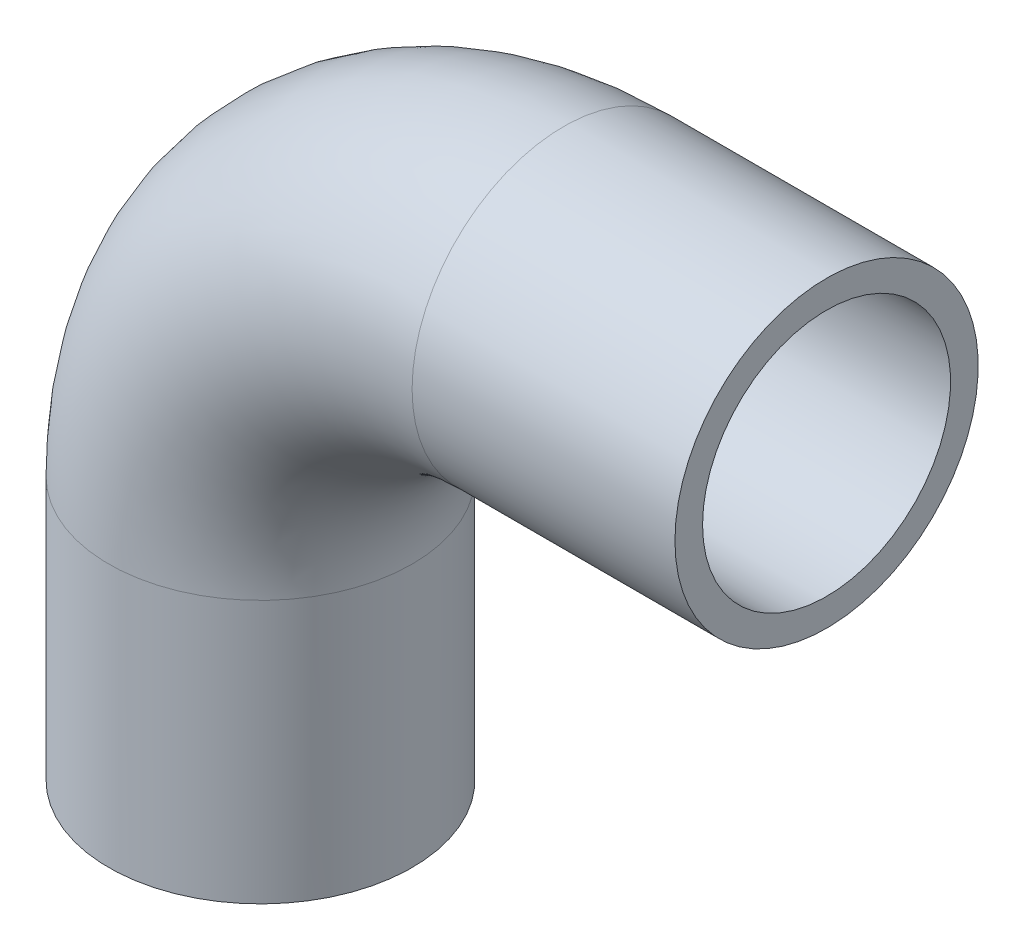
ISO-10303-21;
HEADER;
FILE_DESCRIPTION(('STEP AP214'),'2;1');
FILE_NAME('part.step','',(''),(''),'','','');
FILE_SCHEMA(('AUTOMOTIVE_DESIGN { 1 0 10303 214 1 1 1 1 }'));
ENDSEC;
DATA;
#1=APPLICATION_CONTEXT('core data for automotive mechanical design processes');
#2=APPLICATION_PROTOCOL_DEFINITION('international standard','automotive_design',2000,#1);
#3=PRODUCT_CONTEXT('',#1,'mechanical');
#4=PRODUCT('Part','Part','',(#3));
#5=PRODUCT_RELATED_PRODUCT_CATEGORY('part','',(#4));
#6=PRODUCT_DEFINITION_FORMATION('','',#4);
#7=PRODUCT_DEFINITION_CONTEXT('part definition',#1,'design');
#8=PRODUCT_DEFINITION('design','',#6,#7);
#9=PRODUCT_DEFINITION_SHAPE('','',#8);
#10=(LENGTH_UNIT() NAMED_UNIT(*) SI_UNIT(.MILLI.,.METRE.));
#11=(NAMED_UNIT(*) PLANE_ANGLE_UNIT() SI_UNIT($,.RADIAN.));
#12=(NAMED_UNIT(*) SI_UNIT($,.STERADIAN.) SOLID_ANGLE_UNIT());
#13=UNCERTAINTY_MEASURE_WITH_UNIT(LENGTH_MEASURE(1.E-05),#10,'distance_accuracy_value','');
#14=(GEOMETRIC_REPRESENTATION_CONTEXT(3) GLOBAL_UNCERTAINTY_ASSIGNED_CONTEXT((#13)) GLOBAL_UNIT_ASSIGNED_CONTEXT((#10,
#11,#12)) REPRESENTATION_CONTEXT('',''));
#15=CARTESIAN_POINT('',(0.,0.,0.));
#16=DIRECTION('',(0.,0.,1.));
#17=DIRECTION('',(1.,0.,0.));
#18=AXIS2_PLACEMENT_3D('',#15,#16,#17);
#19=CARTESIAN_POINT('',(90.,78.,0.));
#20=DIRECTION('',(0.,0.,1.));
#21=DIRECTION('',(1.,0.,0.));
#22=AXIS2_PLACEMENT_3D('',#19,#20,#21);
#23=TOROIDAL_SURFACE('',#22,90.,36.8);
#24=CARTESIAN_POINT('',(90.,168.,0.));
#25=DIRECTION('',(-1.,0.,0.));
#26=DIRECTION('',(0.,1.,0.));
#27=AXIS2_PLACEMENT_3D('',#24,#25,#26);
#28=CIRCLE('',#27,36.8);
#29=CARTESIAN_POINT('',(90.,204.8,0.));
#30=VERTEX_POINT('',#29);
#31=EDGE_CURVE('E33',#30,#30,#28,.T.);
#32=ORIENTED_EDGE('',*,*,#31,.F.);
#33=EDGE_LOOP('',(#32));
#34=FACE_BOUND('',#33,.T.);
#35=CARTESIAN_POINT('',(0.,78.,0.));
#36=DIRECTION('',(0.,-1.,0.));
#37=DIRECTION('',(-1.,0.,0.));
#38=AXIS2_PLACEMENT_3D('',#35,#36,#37);
#39=CIRCLE('',#38,36.8);
#40=CARTESIAN_POINT('',(-36.8,78.,0.));
#41=VERTEX_POINT('',#40);
#42=EDGE_CURVE('E31',#41,#41,#39,.F.);
#43=ORIENTED_EDGE('',*,*,#42,.F.);
#44=EDGE_LOOP('',(#43));
#45=FACE_BOUND('',#44,.T.);
#46=ADVANCED_FACE('F13',(#34,#45),#23,.F.);
#47=CARTESIAN_POINT('',(168.,168.,0.));
#48=DIRECTION('',(-1.,0.,0.));
#49=DIRECTION('',(0.,0.,1.));
#50=AXIS2_PLACEMENT_3D('',#47,#48,#49);
#51=CYLINDRICAL_SURFACE('',#50,36.8);
#52=CARTESIAN_POINT('',(168.,168.,0.));
#53=DIRECTION('',(-1.,0.,0.));
#54=DIRECTION('',(0.,0.,1.));
#55=AXIS2_PLACEMENT_3D('',#52,#53,#54);
#56=CIRCLE('',#55,36.8);
#57=CARTESIAN_POINT('',(168.,168.,36.8));
#58=VERTEX_POINT('',#57);
#59=EDGE_CURVE('E17',#58,#58,#56,.T.);
#60=ORIENTED_EDGE('',*,*,#59,.F.);
#61=EDGE_LOOP('',(#60));
#62=FACE_BOUND('',#61,.T.);
#63=ORIENTED_EDGE('',*,*,#31,.T.);
#64=EDGE_LOOP('',(#63));
#65=FACE_BOUND('',#64,.T.);
#66=ADVANCED_FACE('F52',(#62,#65),#51,.F.);
#67=CARTESIAN_POINT('',(0.,78.,0.));
#68=DIRECTION('',(0.,-1.,0.));
#69=DIRECTION('',(0.,0.,-1.));
#70=AXIS2_PLACEMENT_3D('',#67,#68,#69);
#71=CYLINDRICAL_SURFACE('',#70,36.8);
#72=ORIENTED_EDGE('',*,*,#42,.T.);
#73=EDGE_LOOP('',(#72));
#74=FACE_BOUND('',#73,.T.);
#75=CARTESIAN_POINT('',(0.,0.,0.));
#76=DIRECTION('',(0.,-1.,0.));
#77=DIRECTION('',(0.,0.,-1.));
#78=AXIS2_PLACEMENT_3D('',#75,#76,#77);
#79=CIRCLE('',#78,36.8);
#80=CARTESIAN_POINT('',(0.,0.,-36.8));
#81=VERTEX_POINT('',#80);
#82=EDGE_CURVE('E42',#81,#81,#79,.F.);
#83=ORIENTED_EDGE('',*,*,#82,.F.);
#84=EDGE_LOOP('',(#83));
#85=FACE_BOUND('',#84,.T.);
#86=ADVANCED_FACE('F55',(#74,#85),#71,.F.);
#87=CARTESIAN_POINT('',(168.,213.,45.540002108491));
#88=DIRECTION('',(1.,0.,0.));
#89=DIRECTION('',(0.,-1.,0.));
#90=AXIS2_PLACEMENT_3D('',#87,#88,#89);
#91=PLANE('',#90);
#92=ORIENTED_EDGE('',*,*,#59,.T.);
#93=EDGE_LOOP('',(#92));
#94=FACE_BOUND('',#93,.T.);
#95=CARTESIAN_POINT('',(168.,168.,0.));
#96=DIRECTION('',(-1.,0.,0.));
#97=DIRECTION('',(0.,0.,1.));
#98=AXIS2_PLACEMENT_3D('',#95,#96,#97);
#99=CIRCLE('',#98,45.);
#100=CARTESIAN_POINT('',(168.,168.,45.));
#101=VERTEX_POINT('',#100);
#102=EDGE_CURVE('E40',#101,#101,#99,.T.);
#103=ORIENTED_EDGE('',*,*,#102,.F.);
#104=EDGE_LOOP('',(#103));
#105=FACE_BOUND('',#104,.T.);
#106=ADVANCED_FACE('F49',(#94,#105),#91,.T.);
#107=CARTESIAN_POINT('',(45.,0.,45.5400021084901));
#108=DIRECTION('',(0.,-1.,0.));
#109=DIRECTION('',(-1.,0.,0.));
#110=AXIS2_PLACEMENT_3D('',#107,#108,#109);
#111=PLANE('',#110);
#112=ORIENTED_EDGE('',*,*,#82,.T.);
#113=EDGE_LOOP('',(#112));
#114=FACE_BOUND('',#113,.T.);
#115=CARTESIAN_POINT('',(0.,0.,0.));
#116=DIRECTION('',(0.,-1.,0.));
#117=DIRECTION('',(0.,0.,-1.));
#118=AXIS2_PLACEMENT_3D('',#115,#116,#117);
#119=CIRCLE('',#118,45.);
#120=CARTESIAN_POINT('',(0.,0.,-45.));
#121=VERTEX_POINT('',#120);
#122=EDGE_CURVE('E26',#121,#121,#119,.F.);
#123=ORIENTED_EDGE('',*,*,#122,.F.);
#124=EDGE_LOOP('',(#123));
#125=FACE_BOUND('',#124,.T.);
#126=ADVANCED_FACE('F69',(#114,#125),#111,.T.);
#127=CARTESIAN_POINT('',(90.,168.,0.));
#128=DIRECTION('',(-1.,0.,0.));
#129=DIRECTION('',(0.,0.,1.));
#130=AXIS2_PLACEMENT_3D('',#127,#128,#129);
#131=CYLINDRICAL_SURFACE('',#130,45.);
#132=ORIENTED_EDGE('',*,*,#102,.T.);
#133=EDGE_LOOP('',(#132));
#134=FACE_BOUND('',#133,.T.);
#135=CARTESIAN_POINT('',(90.,168.,0.));
#136=DIRECTION('',(-1.,0.,0.));
#137=DIRECTION('',(0.,-1.,0.));
#138=AXIS2_PLACEMENT_3D('',#135,#136,#137);
#139=CIRCLE('',#138,45.);
#140=CARTESIAN_POINT('',(90.,123.,0.));
#141=VERTEX_POINT('',#140);
#142=EDGE_CURVE('E21',#141,#141,#139,.T.);
#143=ORIENTED_EDGE('',*,*,#142,.F.);
#144=EDGE_LOOP('',(#143));
#145=FACE_BOUND('',#144,.T.);
#146=ADVANCED_FACE('F79',(#134,#145),#131,.T.);
#147=CARTESIAN_POINT('',(0.,0.,0.));
#148=DIRECTION('',(0.,-1.,0.));
#149=DIRECTION('',(0.,0.,-1.));
#150=AXIS2_PLACEMENT_3D('',#147,#148,#149);
#151=CYLINDRICAL_SURFACE('',#150,45.);
#152=CARTESIAN_POINT('',(0.,78.,0.));
#153=DIRECTION('',(0.,-1.,0.));
#154=DIRECTION('',(1.,0.,0.));
#155=AXIS2_PLACEMENT_3D('',#152,#153,#154);
#156=CIRCLE('',#155,45.);
#157=CARTESIAN_POINT('',(45.,78.,0.));
#158=VERTEX_POINT('',#157);
#159=EDGE_CURVE('E8',#158,#158,#156,.F.);
#160=ORIENTED_EDGE('',*,*,#159,.F.);
#161=EDGE_LOOP('',(#160));
#162=FACE_BOUND('',#161,.T.);
#163=ORIENTED_EDGE('',*,*,#122,.T.);
#164=EDGE_LOOP('',(#163));
#165=FACE_BOUND('',#164,.T.);
#166=ADVANCED_FACE('F73',(#162,#165),#151,.T.);
#167=CARTESIAN_POINT('',(90.,78.,0.));
#168=DIRECTION('',(0.,0.,1.));
#169=DIRECTION('',(1.,0.,0.));
#170=AXIS2_PLACEMENT_3D('',#167,#168,#169);
#171=TOROIDAL_SURFACE('',#170,90.,45.);
#172=ORIENTED_EDGE('',*,*,#142,.T.);
#173=EDGE_LOOP('',(#172));
#174=FACE_BOUND('',#173,.T.);
#175=ORIENTED_EDGE('',*,*,#159,.T.);
#176=EDGE_LOOP('',(#175));
#177=FACE_BOUND('',#176,.T.);
#178=ADVANCED_FACE('F71',(#174,#177),#171,.T.);
#179=CLOSED_SHELL('',(#46,#66,#86,#106,#126,#146,#166,#178));
#180=MANIFOLD_SOLID_BREP('B1',#179);
#181=ADVANCED_BREP_SHAPE_REPRESENTATION('',(#18,#180),#14);
#182=SHAPE_DEFINITION_REPRESENTATION(#9,#181);
ENDSEC;
END-ISO-10303-21;
